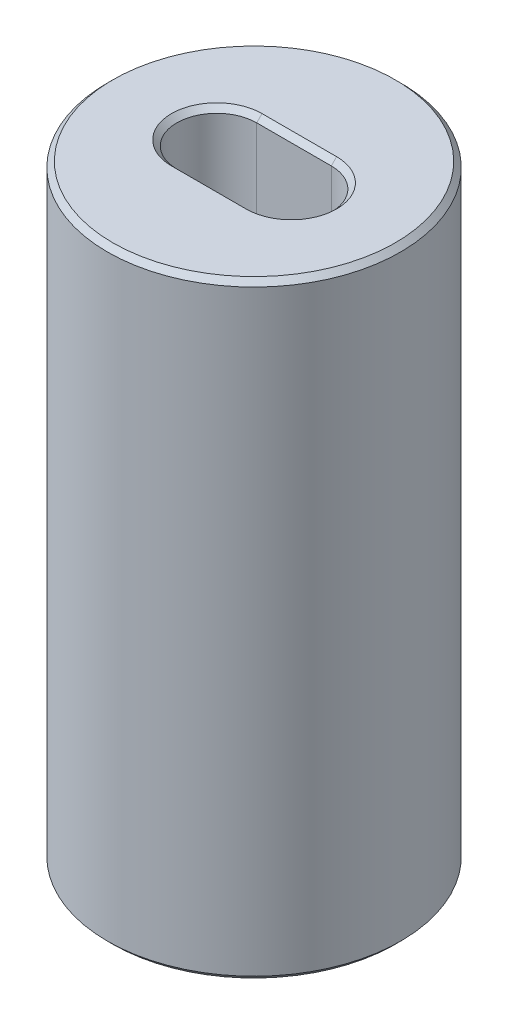
ISO-10303-21;
HEADER;
FILE_DESCRIPTION(('STEP AP214'),'2;1');
FILE_NAME('part.step','',(''),(''),'','','');
FILE_SCHEMA(('AUTOMOTIVE_DESIGN { 1 0 10303 214 1 1 1 1 }'));
ENDSEC;
DATA;
#1=APPLICATION_CONTEXT('core data for automotive mechanical design processes');
#2=APPLICATION_PROTOCOL_DEFINITION('international standard','automotive_design',2000,#1);
#3=PRODUCT_CONTEXT('',#1,'mechanical');
#4=PRODUCT('Part','Part','',(#3));
#5=PRODUCT_RELATED_PRODUCT_CATEGORY('part','',(#4));
#6=PRODUCT_DEFINITION_FORMATION('','',#4);
#7=PRODUCT_DEFINITION_CONTEXT('part definition',#1,'design');
#8=PRODUCT_DEFINITION('design','',#6,#7);
#9=PRODUCT_DEFINITION_SHAPE('','',#8);
#10=(LENGTH_UNIT() NAMED_UNIT(*) SI_UNIT(.MILLI.,.METRE.));
#11=(NAMED_UNIT(*) PLANE_ANGLE_UNIT() SI_UNIT($,.RADIAN.));
#12=(NAMED_UNIT(*) SI_UNIT($,.STERADIAN.) SOLID_ANGLE_UNIT());
#13=UNCERTAINTY_MEASURE_WITH_UNIT(LENGTH_MEASURE(1.E-05),#10,'distance_accuracy_value','');
#14=(GEOMETRIC_REPRESENTATION_CONTEXT(3) GLOBAL_UNCERTAINTY_ASSIGNED_CONTEXT((#13)) GLOBAL_UNIT_ASSIGNED_CONTEXT((#10,
#11,#12)) REPRESENTATION_CONTEXT('',''));
#15=CARTESIAN_POINT('',(0.,0.,0.));
#16=DIRECTION('',(0.,0.,1.));
#17=DIRECTION('',(1.,0.,0.));
#18=AXIS2_PLACEMENT_3D('',#15,#16,#17);
#19=CARTESIAN_POINT('',(0.,5.7,-0.75));
#20=DIRECTION('',(0.,0.,-1.));
#21=DIRECTION('',(-1.,0.,0.));
#22=AXIS2_PLACEMENT_3D('',#19,#20,#21);
#23=PLANE('',#22);
#24=DIRECTION('',(0.,-1.,0.));
#25=VECTOR('',#24,1.);
#26=CARTESIAN_POINT('',(-0.7,5.7,-0.75));
#27=LINE('',#26,#25);
#28=CARTESIAN_POINT('',(-0.7,5.6,-0.75));
#29=VERTEX_POINT('',#28);
#30=CARTESIAN_POINT('',(-0.7,-5.6,-0.75));
#31=VERTEX_POINT('',#30);
#32=EDGE_CURVE('E128',#29,#31,#27,.T.);
#33=ORIENTED_EDGE('',*,*,#32,.T.);
#34=DIRECTION('',(1.,0.,0.));
#35=VECTOR('',#34,1.);
#36=CARTESIAN_POINT('',(0.,-5.6,-0.75));
#37=LINE('',#36,#35);
#38=CARTESIAN_POINT('',(0.7,-5.6,-0.75));
#39=VERTEX_POINT('',#38);
#40=EDGE_CURVE('E11',#31,#39,#37,.T.);
#41=ORIENTED_EDGE('',*,*,#40,.T.);
#42=DIRECTION('',(0.,-1.,0.));
#43=VECTOR('',#42,1.);
#44=CARTESIAN_POINT('',(0.7,5.7,-0.75));
#45=LINE('',#44,#43);
#46=CARTESIAN_POINT('',(0.7,5.6,-0.75));
#47=VERTEX_POINT('',#46);
#48=EDGE_CURVE('E185',#47,#39,#45,.T.);
#49=ORIENTED_EDGE('',*,*,#48,.F.);
#50=DIRECTION('',(-1.,0.,0.));
#51=VECTOR('',#50,1.);
#52=CARTESIAN_POINT('',(-0.7,5.6,-0.75));
#53=LINE('',#52,#51);
#54=EDGE_CURVE('E44',#47,#29,#53,.T.);
#55=ORIENTED_EDGE('',*,*,#54,.T.);
#56=EDGE_LOOP('',(#33,#41,#49,#55));
#57=FACE_BOUND('',#56,.T.);
#58=ADVANCED_FACE('F35',(#57),#23,.F.);
#59=CARTESIAN_POINT('',(0.7,5.7,0.));
#60=DIRECTION('',(0.,-1.,0.));
#61=DIRECTION('',(0.,0.,-1.));
#62=AXIS2_PLACEMENT_3D('',#59,#60,#61);
#63=CYLINDRICAL_SURFACE('',#62,0.75);
#64=ORIENTED_EDGE('',*,*,#48,.T.);
#65=CARTESIAN_POINT('',(0.7,-5.6,0.));
#66=DIRECTION('',(0.,1.,0.));
#67=DIRECTION('',(0.,0.,1.));
#68=AXIS2_PLACEMENT_3D('',#65,#66,#67);
#69=CIRCLE('',#68,0.75);
#70=CARTESIAN_POINT('',(0.7,-5.6,0.75));
#71=VERTEX_POINT('',#70);
#72=EDGE_CURVE('E125',#39,#71,#69,.F.);
#73=ORIENTED_EDGE('',*,*,#72,.T.);
#74=DIRECTION('',(0.,-1.,0.));
#75=VECTOR('',#74,1.);
#76=CARTESIAN_POINT('',(0.7,5.7,0.75));
#77=LINE('',#76,#75);
#78=CARTESIAN_POINT('',(0.7,5.6,0.75));
#79=VERTEX_POINT('',#78);
#80=EDGE_CURVE('E187',#79,#71,#77,.T.);
#81=ORIENTED_EDGE('',*,*,#80,.F.);
#82=CARTESIAN_POINT('',(0.7,5.6,0.));
#83=DIRECTION('',(0.,1.,0.));
#84=DIRECTION('',(0.,0.,1.));
#85=AXIS2_PLACEMENT_3D('',#82,#83,#84);
#86=CIRCLE('',#85,0.75);
#87=EDGE_CURVE('E57',#79,#47,#86,.T.);
#88=ORIENTED_EDGE('',*,*,#87,.T.);
#89=EDGE_LOOP('',(#64,#73,#81,#88));
#90=FACE_BOUND('',#89,.T.);
#91=ADVANCED_FACE('F212',(#90),#63,.F.);
#92=CARTESIAN_POINT('',(0.,5.7,0.75));
#93=DIRECTION('',(0.,0.,-1.));
#94=DIRECTION('',(-1.,0.,0.));
#95=AXIS2_PLACEMENT_3D('',#92,#93,#94);
#96=PLANE('',#95);
#97=ORIENTED_EDGE('',*,*,#80,.T.);
#98=DIRECTION('',(-1.,0.,0.));
#99=VECTOR('',#98,1.);
#100=CARTESIAN_POINT('',(-0.7,-5.6,0.75));
#101=LINE('',#100,#99);
#102=CARTESIAN_POINT('',(-0.7,-5.6,0.75));
#103=VERTEX_POINT('',#102);
#104=EDGE_CURVE('E157',#71,#103,#101,.T.);
#105=ORIENTED_EDGE('',*,*,#104,.T.);
#106=DIRECTION('',(0.,-1.,0.));
#107=VECTOR('',#106,1.);
#108=CARTESIAN_POINT('',(-0.7,5.7,0.75));
#109=LINE('',#108,#107);
#110=CARTESIAN_POINT('',(-0.7,5.6,0.75));
#111=VERTEX_POINT('',#110);
#112=EDGE_CURVE('E190',#111,#103,#109,.T.);
#113=ORIENTED_EDGE('',*,*,#112,.F.);
#114=DIRECTION('',(1.,0.,0.));
#115=VECTOR('',#114,1.);
#116=CARTESIAN_POINT('',(0.,5.6,0.75));
#117=LINE('',#116,#115);
#118=EDGE_CURVE('E160',#111,#79,#117,.T.);
#119=ORIENTED_EDGE('',*,*,#118,.T.);
#120=EDGE_LOOP('',(#97,#105,#113,#119));
#121=FACE_BOUND('',#120,.T.);
#122=ADVANCED_FACE('F217',(#121),#96,.T.);
#123=CARTESIAN_POINT('',(-0.7,5.7,0.));
#124=DIRECTION('',(0.,-1.,0.));
#125=DIRECTION('',(0.,0.,-1.));
#126=AXIS2_PLACEMENT_3D('',#123,#124,#125);
#127=CYLINDRICAL_SURFACE('',#126,0.75);
#128=ORIENTED_EDGE('',*,*,#112,.T.);
#129=CARTESIAN_POINT('',(-0.7,-5.6,0.));
#130=DIRECTION('',(0.,1.,0.));
#131=DIRECTION('',(0.,0.,1.));
#132=AXIS2_PLACEMENT_3D('',#129,#130,#131);
#133=CIRCLE('',#132,0.75);
#134=EDGE_CURVE('E153',#103,#31,#133,.F.);
#135=ORIENTED_EDGE('',*,*,#134,.T.);
#136=ORIENTED_EDGE('',*,*,#32,.F.);
#137=CARTESIAN_POINT('',(-0.7,5.6,0.));
#138=DIRECTION('',(0.,1.,0.));
#139=DIRECTION('',(0.,0.,1.));
#140=AXIS2_PLACEMENT_3D('',#137,#138,#139);
#141=CIRCLE('',#140,0.75);
#142=EDGE_CURVE('E155',#29,#111,#141,.T.);
#143=ORIENTED_EDGE('',*,*,#142,.T.);
#144=EDGE_LOOP('',(#128,#135,#136,#143));
#145=FACE_BOUND('',#144,.T.);
#146=ADVANCED_FACE('F250',(#145),#127,.F.);
#147=CARTESIAN_POINT('',(0.,5.7,0.));
#148=DIRECTION('',(0.,-1.,0.));
#149=DIRECTION('',(0.,0.,-1.));
#150=AXIS2_PLACEMENT_3D('',#147,#148,#149);
#151=CYLINDRICAL_SURFACE('',#150,2.75);
#152=CARTESIAN_POINT('',(0.,-5.6,0.));
#153=DIRECTION('',(0.,1.,0.));
#154=DIRECTION('',(0.,0.,1.));
#155=AXIS2_PLACEMENT_3D('',#152,#153,#154);
#156=CIRCLE('',#155,2.75);
#157=CARTESIAN_POINT('',(0.,-5.6,2.75));
#158=VERTEX_POINT('',#157);
#159=EDGE_CURVE('E122',#158,#158,#156,.T.);
#160=ORIENTED_EDGE('',*,*,#159,.T.);
#161=EDGE_LOOP('',(#160));
#162=FACE_BOUND('',#161,.T.);
#163=CARTESIAN_POINT('',(0.,5.6,0.));
#164=DIRECTION('',(0.,1.,0.));
#165=DIRECTION('',(0.,0.,1.));
#166=AXIS2_PLACEMENT_3D('',#163,#164,#165);
#167=CIRCLE('',#166,2.75);
#168=CARTESIAN_POINT('',(0.,5.6,2.75));
#169=VERTEX_POINT('',#168);
#170=EDGE_CURVE('E182',#169,#169,#167,.F.);
#171=ORIENTED_EDGE('',*,*,#170,.T.);
#172=EDGE_LOOP('',(#171));
#173=FACE_BOUND('',#172,.T.);
#174=ADVANCED_FACE('F238',(#162,#173),#151,.T.);
#175=CARTESIAN_POINT('',(0.,5.7,0.));
#176=DIRECTION('',(0.,1.,0.));
#177=DIRECTION('',(0.,0.,1.));
#178=AXIS2_PLACEMENT_3D('',#175,#176,#177);
#179=PLANE('',#178);
#180=CARTESIAN_POINT('',(0.,5.7,0.));
#181=DIRECTION('',(0.,1.,0.));
#182=DIRECTION('',(0.,0.,1.));
#183=AXIS2_PLACEMENT_3D('',#180,#181,#182);
#184=CIRCLE('',#183,2.65);
#185=CARTESIAN_POINT('',(0.,5.7,2.65));
#186=VERTEX_POINT('',#185);
#187=EDGE_CURVE('E163',#186,#186,#184,.T.);
#188=ORIENTED_EDGE('',*,*,#187,.T.);
#189=EDGE_LOOP('',(#188));
#190=FACE_BOUND('',#189,.T.);
#191=CARTESIAN_POINT('',(0.7,5.7,0.));
#192=DIRECTION('',(0.,1.,0.));
#193=DIRECTION('',(0.,0.,1.));
#194=AXIS2_PLACEMENT_3D('',#191,#192,#193);
#195=CIRCLE('',#194,0.849999999999999);
#196=CARTESIAN_POINT('',(0.7,5.7,-0.85));
#197=VERTEX_POINT('',#196);
#198=CARTESIAN_POINT('',(0.7,5.7,0.849999999999999));
#199=VERTEX_POINT('',#198);
#200=EDGE_CURVE('E171',#197,#199,#195,.F.);
#201=ORIENTED_EDGE('',*,*,#200,.T.);
#202=DIRECTION('',(-1.,0.,0.));
#203=VECTOR('',#202,1.);
#204=CARTESIAN_POINT('',(0.,5.7,0.849999999999999));
#205=LINE('',#204,#203);
#206=CARTESIAN_POINT('',(-0.7,5.7,0.85));
#207=VERTEX_POINT('',#206);
#208=EDGE_CURVE('E166',#199,#207,#205,.T.);
#209=ORIENTED_EDGE('',*,*,#208,.T.);
#210=CARTESIAN_POINT('',(-0.7,5.7,0.));
#211=DIRECTION('',(0.,1.,0.));
#212=DIRECTION('',(0.,0.,1.));
#213=AXIS2_PLACEMENT_3D('',#210,#211,#212);
#214=CIRCLE('',#213,0.849999999999999);
#215=CARTESIAN_POINT('',(-0.7,5.7,-0.849999999999999));
#216=VERTEX_POINT('',#215);
#217=EDGE_CURVE('E169',#207,#216,#214,.F.);
#218=ORIENTED_EDGE('',*,*,#217,.T.);
#219=DIRECTION('',(1.,0.,0.));
#220=VECTOR('',#219,1.);
#221=CARTESIAN_POINT('',(0.7,5.7,-0.85));
#222=LINE('',#221,#220);
#223=EDGE_CURVE('E173',#216,#197,#222,.T.);
#224=ORIENTED_EDGE('',*,*,#223,.T.);
#225=EDGE_LOOP('',(#201,#209,#218,#224));
#226=FACE_BOUND('',#225,.T.);
#227=ADVANCED_FACE('F235',(#190,#226),#179,.T.);
#228=CARTESIAN_POINT('',(0.,-5.7,0.));
#229=DIRECTION('',(0.,1.,0.));
#230=DIRECTION('',(0.,0.,1.));
#231=AXIS2_PLACEMENT_3D('',#228,#229,#230);
#232=PLANE('',#231);
#233=CARTESIAN_POINT('',(0.,-5.7,0.));
#234=DIRECTION('',(0.,1.,0.));
#235=DIRECTION('',(0.,0.,1.));
#236=AXIS2_PLACEMENT_3D('',#233,#234,#235);
#237=CIRCLE('',#236,2.65);
#238=CARTESIAN_POINT('',(0.,-5.7,2.65));
#239=VERTEX_POINT('',#238);
#240=EDGE_CURVE('E175',#239,#239,#237,.F.);
#241=ORIENTED_EDGE('',*,*,#240,.T.);
#242=EDGE_LOOP('',(#241));
#243=FACE_BOUND('',#242,.T.);
#244=CARTESIAN_POINT('',(-0.7,-5.7,0.));
#245=DIRECTION('',(0.,1.,0.));
#246=DIRECTION('',(0.,0.,1.));
#247=AXIS2_PLACEMENT_3D('',#244,#245,#246);
#248=CIRCLE('',#247,0.849999999999999);
#249=CARTESIAN_POINT('',(-0.7,-5.7,-0.849999999999999));
#250=VERTEX_POINT('',#249);
#251=CARTESIAN_POINT('',(-0.7,-5.7,0.85));
#252=VERTEX_POINT('',#251);
#253=EDGE_CURVE('E112',#250,#252,#248,.T.);
#254=ORIENTED_EDGE('',*,*,#253,.T.);
#255=DIRECTION('',(1.,0.,0.));
#256=VECTOR('',#255,1.);
#257=CARTESIAN_POINT('',(0.7,-5.7,0.849999999999999));
#258=LINE('',#257,#256);
#259=CARTESIAN_POINT('',(0.7,-5.7,0.849999999999999));
#260=VERTEX_POINT('',#259);
#261=EDGE_CURVE('E108',#252,#260,#258,.T.);
#262=ORIENTED_EDGE('',*,*,#261,.T.);
#263=CARTESIAN_POINT('',(0.7,-5.7,0.));
#264=DIRECTION('',(0.,1.,0.));
#265=DIRECTION('',(0.,0.,1.));
#266=AXIS2_PLACEMENT_3D('',#263,#264,#265);
#267=CIRCLE('',#266,0.849999999999999);
#268=CARTESIAN_POINT('',(0.7,-5.7,-0.85));
#269=VERTEX_POINT('',#268);
#270=EDGE_CURVE('E102',#260,#269,#267,.T.);
#271=ORIENTED_EDGE('',*,*,#270,.T.);
#272=DIRECTION('',(-1.,0.,0.));
#273=VECTOR('',#272,1.);
#274=CARTESIAN_POINT('',(0.,-5.7,-0.849999999999999));
#275=LINE('',#274,#273);
#276=EDGE_CURVE('E105',#269,#250,#275,.T.);
#277=ORIENTED_EDGE('',*,*,#276,.T.);
#278=EDGE_LOOP('',(#254,#262,#271,#277));
#279=FACE_BOUND('',#278,.T.);
#280=ADVANCED_FACE('F104',(#243,#279),#232,.F.);
#281=CARTESIAN_POINT('',(0.,-5.6,0.));
#282=DIRECTION('',(0.,1.,0.));
#283=DIRECTION('',(0.,0.,1.));
#284=AXIS2_PLACEMENT_3D('',#281,#282,#283);
#285=CONICAL_SURFACE('',#284,2.75,0.785398163397453);
#286=ORIENTED_EDGE('',*,*,#240,.F.);
#287=EDGE_LOOP('',(#286));
#288=FACE_BOUND('',#287,.T.);
#289=ORIENTED_EDGE('',*,*,#159,.F.);
#290=EDGE_LOOP('',(#289));
#291=FACE_BOUND('',#290,.T.);
#292=ADVANCED_FACE('F221',(#288,#291),#285,.T.);
#293=CARTESIAN_POINT('',(0.,5.7,0.));
#294=DIRECTION('',(0.,-1.,0.));
#295=DIRECTION('',(0.,0.,-1.));
#296=AXIS2_PLACEMENT_3D('',#293,#294,#295);
#297=CONICAL_SURFACE('',#296,2.65,0.78539816339744);
#298=ORIENTED_EDGE('',*,*,#170,.F.);
#299=EDGE_LOOP('',(#298));
#300=FACE_BOUND('',#299,.T.);
#301=ORIENTED_EDGE('',*,*,#187,.F.);
#302=EDGE_LOOP('',(#301));
#303=FACE_BOUND('',#302,.T.);
#304=ADVANCED_FACE('F223',(#300,#303),#297,.T.);
#305=CARTESIAN_POINT('',(0.,-5.6,-0.75));
#306=DIRECTION('',(0.,0.707106781186548,-0.707106781186548));
#307=DIRECTION('',(1.,0.,0.));
#308=AXIS2_PLACEMENT_3D('',#305,#306,#307);
#309=PLANE('',#308);
#310=DIRECTION('',(0.,-0.707106781186548,-0.707106781186548));
#311=VECTOR('',#310,1.);
#312=CARTESIAN_POINT('',(0.7,-5.6,-0.75));
#313=LINE('',#312,#311);
#314=EDGE_CURVE('E117',#39,#269,#313,.T.);
#315=ORIENTED_EDGE('',*,*,#314,.F.);
#316=ORIENTED_EDGE('',*,*,#40,.F.);
#317=DIRECTION('',(0.,0.707106781186548,0.707106781186548));
#318=VECTOR('',#317,1.);
#319=CARTESIAN_POINT('',(-0.7,-5.7,-0.849999999999999));
#320=LINE('',#319,#318);
#321=EDGE_CURVE('E120',#250,#31,#320,.T.);
#322=ORIENTED_EDGE('',*,*,#321,.F.);
#323=ORIENTED_EDGE('',*,*,#276,.F.);
#324=EDGE_LOOP('',(#315,#316,#322,#323));
#325=FACE_BOUND('',#324,.T.);
#326=ADVANCED_FACE('F116',(#325),#309,.F.);
#327=CARTESIAN_POINT('',(-0.7,-5.7,0.));
#328=DIRECTION('',(0.,-1.,0.));
#329=DIRECTION('',(0.,0.,-1.));
#330=AXIS2_PLACEMENT_3D('',#327,#328,#329);
#331=CONICAL_SURFACE('',#330,0.849999999999999,0.785398163397448);
#332=ORIENTED_EDGE('',*,*,#321,.T.);
#333=ORIENTED_EDGE('',*,*,#134,.F.);
#334=DIRECTION('',(0.,0.707106781186548,-0.707106781186548));
#335=VECTOR('',#334,1.);
#336=CARTESIAN_POINT('',(-0.7,-5.7,0.85));
#337=LINE('',#336,#335);
#338=EDGE_CURVE('E126',#252,#103,#337,.T.);
#339=ORIENTED_EDGE('',*,*,#338,.F.);
#340=ORIENTED_EDGE('',*,*,#253,.F.);
#341=EDGE_LOOP('',(#332,#333,#339,#340));
#342=FACE_BOUND('',#341,.T.);
#343=ADVANCED_FACE('F198',(#342),#331,.F.);
#344=CARTESIAN_POINT('',(0.7,-5.7,0.));
#345=DIRECTION('',(0.,-1.,0.));
#346=DIRECTION('',(0.,0.,-1.));
#347=AXIS2_PLACEMENT_3D('',#344,#345,#346);
#348=CONICAL_SURFACE('',#347,0.849999999999999,0.785398163397448);
#349=ORIENTED_EDGE('',*,*,#314,.T.);
#350=ORIENTED_EDGE('',*,*,#270,.F.);
#351=DIRECTION('',(0.,-0.707106781186548,0.707106781186548));
#352=VECTOR('',#351,1.);
#353=CARTESIAN_POINT('',(0.7,-5.6,0.75));
#354=LINE('',#353,#352);
#355=EDGE_CURVE('E130',#71,#260,#354,.T.);
#356=ORIENTED_EDGE('',*,*,#355,.F.);
#357=ORIENTED_EDGE('',*,*,#72,.F.);
#358=EDGE_LOOP('',(#349,#350,#356,#357));
#359=FACE_BOUND('',#358,.T.);
#360=ADVANCED_FACE('F124',(#359),#348,.F.);
#361=CARTESIAN_POINT('',(0.,-5.7,0.849999999999999));
#362=DIRECTION('',(0.,-0.707106781186548,-0.707106781186548));
#363=DIRECTION('',(-1.,0.,0.));
#364=AXIS2_PLACEMENT_3D('',#361,#362,#363);
#365=PLANE('',#364);
#366=ORIENTED_EDGE('',*,*,#338,.T.);
#367=ORIENTED_EDGE('',*,*,#104,.F.);
#368=ORIENTED_EDGE('',*,*,#355,.T.);
#369=ORIENTED_EDGE('',*,*,#261,.F.);
#370=EDGE_LOOP('',(#366,#367,#368,#369));
#371=FACE_BOUND('',#370,.T.);
#372=ADVANCED_FACE('F200',(#371),#365,.T.);
#373=CARTESIAN_POINT('',(0.,5.7,-0.849999999999999));
#374=DIRECTION('',(0.,0.707106781186548,0.707106781186548));
#375=DIRECTION('',(-1.,0.,0.));
#376=AXIS2_PLACEMENT_3D('',#373,#374,#375);
#377=PLANE('',#376);
#378=DIRECTION('',(0.,-0.707106781186548,0.707106781186548));
#379=VECTOR('',#378,1.);
#380=CARTESIAN_POINT('',(0.7,5.7,-0.85));
#381=LINE('',#380,#379);
#382=EDGE_CURVE('E137',#197,#47,#381,.T.);
#383=ORIENTED_EDGE('',*,*,#382,.F.);
#384=ORIENTED_EDGE('',*,*,#223,.F.);
#385=DIRECTION('',(0.,0.707106781186548,-0.707106781186548));
#386=VECTOR('',#385,1.);
#387=CARTESIAN_POINT('',(-0.7,5.6,-0.75));
#388=LINE('',#387,#386);
#389=EDGE_CURVE('E39',#29,#216,#388,.T.);
#390=ORIENTED_EDGE('',*,*,#389,.F.);
#391=ORIENTED_EDGE('',*,*,#54,.F.);
#392=EDGE_LOOP('',(#383,#384,#390,#391));
#393=FACE_BOUND('',#392,.T.);
#394=ADVANCED_FACE('F37',(#393),#377,.T.);
#395=CARTESIAN_POINT('',(-0.7,5.6,0.));
#396=DIRECTION('',(0.,1.,0.));
#397=DIRECTION('',(0.,0.,1.));
#398=AXIS2_PLACEMENT_3D('',#395,#396,#397);
#399=CONICAL_SURFACE('',#398,0.75,0.785398163397448);
#400=ORIENTED_EDGE('',*,*,#389,.T.);
#401=ORIENTED_EDGE('',*,*,#217,.F.);
#402=DIRECTION('',(0.,0.707106781186548,0.707106781186548));
#403=VECTOR('',#402,1.);
#404=CARTESIAN_POINT('',(-0.7,5.6,0.75));
#405=LINE('',#404,#403);
#406=EDGE_CURVE('E136',#111,#207,#405,.T.);
#407=ORIENTED_EDGE('',*,*,#406,.F.);
#408=ORIENTED_EDGE('',*,*,#142,.F.);
#409=EDGE_LOOP('',(#400,#401,#407,#408));
#410=FACE_BOUND('',#409,.T.);
#411=ADVANCED_FACE('F207',(#410),#399,.F.);
#412=CARTESIAN_POINT('',(0.7,5.6,0.));
#413=DIRECTION('',(0.,1.,0.));
#414=DIRECTION('',(0.,0.,1.));
#415=AXIS2_PLACEMENT_3D('',#412,#413,#414);
#416=CONICAL_SURFACE('',#415,0.75,0.785398163397448);
#417=ORIENTED_EDGE('',*,*,#382,.T.);
#418=ORIENTED_EDGE('',*,*,#87,.F.);
#419=DIRECTION('',(0.,-0.707106781186548,-0.707106781186548));
#420=VECTOR('',#419,1.);
#421=CARTESIAN_POINT('',(0.7,5.7,0.849999999999999));
#422=LINE('',#421,#420);
#423=EDGE_CURVE('E134',#199,#79,#422,.T.);
#424=ORIENTED_EDGE('',*,*,#423,.F.);
#425=ORIENTED_EDGE('',*,*,#200,.F.);
#426=EDGE_LOOP('',(#417,#418,#424,#425));
#427=FACE_BOUND('',#426,.T.);
#428=ADVANCED_FACE('F247',(#427),#416,.F.);
#429=CARTESIAN_POINT('',(0.,5.6,0.75));
#430=DIRECTION('',(0.,-0.707106781186548,0.707106781186548));
#431=DIRECTION('',(1.,0.,0.));
#432=AXIS2_PLACEMENT_3D('',#429,#430,#431);
#433=PLANE('',#432);
#434=ORIENTED_EDGE('',*,*,#406,.T.);
#435=ORIENTED_EDGE('',*,*,#208,.F.);
#436=ORIENTED_EDGE('',*,*,#423,.T.);
#437=ORIENTED_EDGE('',*,*,#118,.F.);
#438=EDGE_LOOP('',(#434,#435,#436,#437));
#439=FACE_BOUND('',#438,.T.);
#440=ADVANCED_FACE('F244',(#439),#433,.F.);
#441=CLOSED_SHELL('',(#58,#91,#122,#146,#174,#227,#280,#292,#304,#326,#343,#360,#372,#394,#411,
#428,#440));
#442=MANIFOLD_SOLID_BREP('B2',#441);
#443=ADVANCED_BREP_SHAPE_REPRESENTATION('',(#18,#442),#14);
#444=SHAPE_DEFINITION_REPRESENTATION(#9,#443);
ENDSEC;
END-ISO-10303-21;
